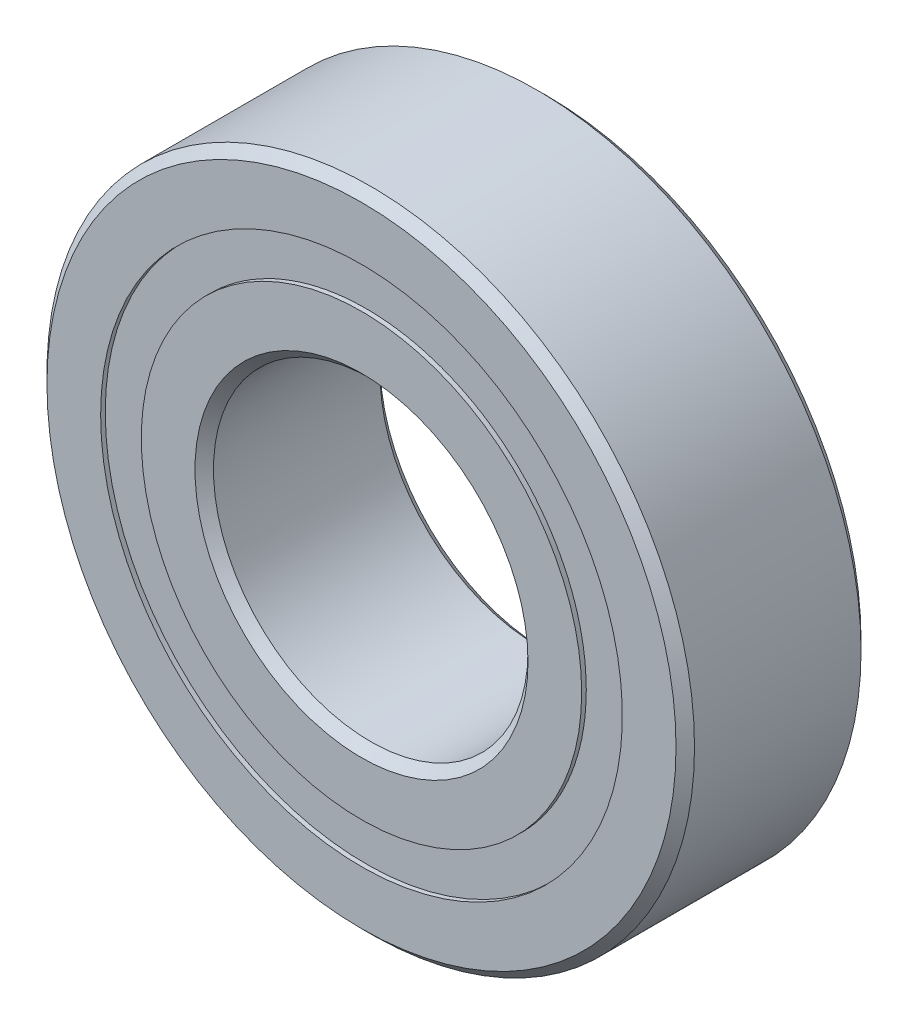
ISO-10303-21;
HEADER;
FILE_DESCRIPTION(('STEP AP214'),'2;1');
FILE_NAME('part.step','',(''),(''),'','','');
FILE_SCHEMA(('AUTOMOTIVE_DESIGN { 1 0 10303 214 1 1 1 1 }'));
ENDSEC;
DATA;
#1=APPLICATION_CONTEXT('core data for automotive mechanical design processes');
#2=APPLICATION_PROTOCOL_DEFINITION('international standard','automotive_design',2000,#1);
#3=PRODUCT_CONTEXT('',#1,'mechanical');
#4=PRODUCT('Part','Part','',(#3));
#5=PRODUCT_RELATED_PRODUCT_CATEGORY('part','',(#4));
#6=PRODUCT_DEFINITION_FORMATION('','',#4);
#7=PRODUCT_DEFINITION_CONTEXT('part definition',#1,'design');
#8=PRODUCT_DEFINITION('design','',#6,#7);
#9=PRODUCT_DEFINITION_SHAPE('','',#8);
#10=(LENGTH_UNIT() NAMED_UNIT(*) SI_UNIT(.MILLI.,.METRE.));
#11=(NAMED_UNIT(*) PLANE_ANGLE_UNIT() SI_UNIT($,.RADIAN.));
#12=(NAMED_UNIT(*) SI_UNIT($,.STERADIAN.) SOLID_ANGLE_UNIT());
#13=UNCERTAINTY_MEASURE_WITH_UNIT(LENGTH_MEASURE(1.E-05),#10,'distance_accuracy_value','');
#14=(GEOMETRIC_REPRESENTATION_CONTEXT(3) GLOBAL_UNCERTAINTY_ASSIGNED_CONTEXT((#13)) GLOBAL_UNIT_ASSIGNED_CONTEXT((#10,
#11,#12)) REPRESENTATION_CONTEXT('',''));
#15=CARTESIAN_POINT('',(0.,0.,0.));
#16=DIRECTION('',(0.,0.,1.));
#17=DIRECTION('',(1.,0.,0.));
#18=AXIS2_PLACEMENT_3D('',#15,#16,#17);
#19=CARTESIAN_POINT('',(0.,0.,5.));
#20=DIRECTION('',(0.,0.,1.));
#21=DIRECTION('',(-1.,0.,0.));
#22=AXIS2_PLACEMENT_3D('',#19,#20,#21);
#23=CYLINDRICAL_SURFACE('',#22,14.0989010989011);
#24=CARTESIAN_POINT('',(0.,0.,-4.75));
#25=DIRECTION('',(0.,0.,-1.));
#26=DIRECTION('',(-1.,0.,0.));
#27=AXIS2_PLACEMENT_3D('',#24,#25,#26);
#28=CIRCLE('',#27,14.0989010989011);
#29=CARTESIAN_POINT('',(-14.0989010989011,0.,-4.75));
#30=VERTEX_POINT('',#29);
#31=EDGE_CURVE('E11',#30,#30,#28,.T.);
#32=ORIENTED_EDGE('',*,*,#31,.F.);
#33=EDGE_LOOP('',(#32));
#34=FACE_BOUND('',#33,.T.);
#35=CARTESIAN_POINT('',(0.,0.,-5.));
#36=DIRECTION('',(0.,0.,-1.));
#37=DIRECTION('',(-1.,0.,0.));
#38=AXIS2_PLACEMENT_3D('',#35,#36,#37);
#39=CIRCLE('',#38,14.0989010989011);
#40=CARTESIAN_POINT('',(-14.0989010989011,0.,-5.));
#41=VERTEX_POINT('',#40);
#42=EDGE_CURVE('E103',#41,#41,#39,.T.);
#43=ORIENTED_EDGE('',*,*,#42,.T.);
#44=EDGE_LOOP('',(#43));
#45=FACE_BOUND('',#44,.T.);
#46=ADVANCED_FACE('F52',(#34,#45),#23,.F.);
#47=CARTESIAN_POINT('',(0.,14.0989010989011,-4.75));
#48=DIRECTION('',(0.,0.,-1.));
#49=DIRECTION('',(1.,0.,0.));
#50=AXIS2_PLACEMENT_3D('',#47,#48,#49);
#51=PLANE('',#50);
#52=CARTESIAN_POINT('',(0.,0.,-4.75));
#53=DIRECTION('',(0.,0.,-1.));
#54=DIRECTION('',(-1.,0.,0.));
#55=AXIS2_PLACEMENT_3D('',#52,#53,#54);
#56=CIRCLE('',#55,11.9010989010989);
#57=CARTESIAN_POINT('',(-11.9010989010989,0.,-4.75));
#58=VERTEX_POINT('',#57);
#59=EDGE_CURVE('E59',#58,#58,#56,.T.);
#60=ORIENTED_EDGE('',*,*,#59,.F.);
#61=EDGE_LOOP('',(#60));
#62=FACE_BOUND('',#61,.T.);
#63=ORIENTED_EDGE('',*,*,#31,.T.);
#64=EDGE_LOOP('',(#63));
#65=FACE_BOUND('',#64,.T.);
#66=ADVANCED_FACE('F165',(#62,#65),#51,.T.);
#67=CARTESIAN_POINT('',(0.,0.,5.));
#68=DIRECTION('',(0.,0.,1.));
#69=DIRECTION('',(-1.,0.,0.));
#70=AXIS2_PLACEMENT_3D('',#67,#68,#69);
#71=CYLINDRICAL_SURFACE('',#70,11.9010989010989);
#72=CARTESIAN_POINT('',(0.,0.,-2.47908354641475));
#73=DIRECTION('',(0.,0.,-1.));
#74=DIRECTION('',(-1.,0.,0.));
#75=AXIS2_PLACEMENT_3D('',#72,#73,#74);
#76=CIRCLE('',#75,11.9010989010989);
#77=CARTESIAN_POINT('',(-11.9010989010989,0.,-2.47908354641475));
#78=VERTEX_POINT('',#77);
#79=EDGE_CURVE('E64',#78,#78,#76,.T.);
#80=ORIENTED_EDGE('',*,*,#79,.F.);
#81=EDGE_LOOP('',(#80));
#82=FACE_BOUND('',#81,.T.);
#83=ORIENTED_EDGE('',*,*,#59,.T.);
#84=EDGE_LOOP('',(#83));
#85=FACE_BOUND('',#84,.T.);
#86=ADVANCED_FACE('F160',(#82,#85),#71,.F.);
#87=CARTESIAN_POINT('',(0.,13.0637193818456,-2.47908354641475));
#88=DIRECTION('',(0.,0.,1.));
#89=DIRECTION('',(-1.,0.,0.));
#90=AXIS2_PLACEMENT_3D('',#87,#88,#89);
#91=PLANE('',#90);
#92=CARTESIAN_POINT('',(0.,0.,-2.47908354641475));
#93=DIRECTION('',(0.,0.,-1.));
#94=DIRECTION('',(-1.,0.,0.));
#95=AXIS2_PLACEMENT_3D('',#92,#93,#94);
#96=CIRCLE('',#95,13.0637193818456);
#97=CARTESIAN_POINT('',(-13.0637193818456,0.,-2.47908354641475));
#98=VERTEX_POINT('',#97);
#99=EDGE_CURVE('E69',#98,#98,#96,.T.);
#100=ORIENTED_EDGE('',*,*,#99,.F.);
#101=EDGE_LOOP('',(#100));
#102=FACE_BOUND('',#101,.T.);
#103=ORIENTED_EDGE('',*,*,#79,.T.);
#104=EDGE_LOOP('',(#103));
#105=FACE_BOUND('',#104,.T.);
#106=ADVANCED_FACE('F154',(#102,#105),#91,.T.);
#107=CARTESIAN_POINT('',(0.,0.,0.));
#108=DIRECTION('',(0.,0.,1.));
#109=DIRECTION('',(-1.,0.,0.));
#110=AXIS2_PLACEMENT_3D('',#107,#108,#109);
#111=TOROIDAL_SURFACE('',#110,12.9963044732891,2.48);
#112=CARTESIAN_POINT('',(0.,0.,2.47908354641475));
#113=DIRECTION('',(0.,0.,-1.));
#114=DIRECTION('',(-1.,0.,0.));
#115=AXIS2_PLACEMENT_3D('',#112,#113,#114);
#116=CIRCLE('',#115,13.0637193818456);
#117=CARTESIAN_POINT('',(-13.0637193818456,0.,2.47908354641475));
#118=VERTEX_POINT('',#117);
#119=EDGE_CURVE('E75',#118,#118,#116,.T.);
#120=ORIENTED_EDGE('',*,*,#119,.F.);
#121=EDGE_LOOP('',(#120));
#122=FACE_BOUND('',#121,.T.);
#123=ORIENTED_EDGE('',*,*,#99,.T.);
#124=EDGE_LOOP('',(#123));
#125=FACE_BOUND('',#124,.T.);
#126=ADVANCED_FACE('F148',(#122,#125),#111,.F.);
#127=CARTESIAN_POINT('',(0.,13.0637193818456,2.47908354641475));
#128=DIRECTION('',(0.,0.,-1.));
#129=DIRECTION('',(1.,0.,0.));
#130=AXIS2_PLACEMENT_3D('',#127,#128,#129);
#131=PLANE('',#130);
#132=CARTESIAN_POINT('',(0.,0.,2.47908354641475));
#133=DIRECTION('',(0.,0.,-1.));
#134=DIRECTION('',(-1.,0.,0.));
#135=AXIS2_PLACEMENT_3D('',#132,#133,#134);
#136=CIRCLE('',#135,11.9010989010989);
#137=CARTESIAN_POINT('',(-11.9010989010989,0.,2.47908354641475));
#138=VERTEX_POINT('',#137);
#139=EDGE_CURVE('E79',#138,#138,#136,.T.);
#140=ORIENTED_EDGE('',*,*,#139,.F.);
#141=EDGE_LOOP('',(#140));
#142=FACE_BOUND('',#141,.T.);
#143=ORIENTED_EDGE('',*,*,#119,.T.);
#144=EDGE_LOOP('',(#143));
#145=FACE_BOUND('',#144,.T.);
#146=ADVANCED_FACE('F142',(#142,#145),#131,.T.);
#147=CARTESIAN_POINT('',(0.,0.,5.));
#148=DIRECTION('',(0.,0.,1.));
#149=DIRECTION('',(-1.,0.,0.));
#150=AXIS2_PLACEMENT_3D('',#147,#148,#149);
#151=CYLINDRICAL_SURFACE('',#150,11.9010989010989);
#152=CARTESIAN_POINT('',(0.,0.,4.75));
#153=DIRECTION('',(0.,0.,-1.));
#154=DIRECTION('',(-1.,0.,0.));
#155=AXIS2_PLACEMENT_3D('',#152,#153,#154);
#156=CIRCLE('',#155,11.9010989010989);
#157=CARTESIAN_POINT('',(-11.9010989010989,0.,4.75));
#158=VERTEX_POINT('',#157);
#159=EDGE_CURVE('E83',#158,#158,#156,.T.);
#160=ORIENTED_EDGE('',*,*,#159,.F.);
#161=EDGE_LOOP('',(#160));
#162=FACE_BOUND('',#161,.T.);
#163=ORIENTED_EDGE('',*,*,#139,.T.);
#164=EDGE_LOOP('',(#163));
#165=FACE_BOUND('',#164,.T.);
#166=ADVANCED_FACE('F136',(#162,#165),#151,.F.);
#167=CARTESIAN_POINT('',(0.,14.0989010989011,4.75));
#168=DIRECTION('',(0.,0.,1.));
#169=DIRECTION('',(-1.,0.,0.));
#170=AXIS2_PLACEMENT_3D('',#167,#168,#169);
#171=PLANE('',#170);
#172=CARTESIAN_POINT('',(0.,0.,4.75));
#173=DIRECTION('',(0.,0.,-1.));
#174=DIRECTION('',(-1.,0.,0.));
#175=AXIS2_PLACEMENT_3D('',#172,#173,#174);
#176=CIRCLE('',#175,14.0989010989011);
#177=CARTESIAN_POINT('',(-14.0989010989011,0.,4.75));
#178=VERTEX_POINT('',#177);
#179=EDGE_CURVE('E87',#178,#178,#176,.T.);
#180=ORIENTED_EDGE('',*,*,#179,.F.);
#181=EDGE_LOOP('',(#180));
#182=FACE_BOUND('',#181,.T.);
#183=ORIENTED_EDGE('',*,*,#159,.T.);
#184=EDGE_LOOP('',(#183));
#185=FACE_BOUND('',#184,.T.);
#186=ADVANCED_FACE('F130',(#182,#185),#171,.T.);
#187=CARTESIAN_POINT('',(0.,0.,5.));
#188=DIRECTION('',(0.,0.,1.));
#189=DIRECTION('',(-1.,0.,0.));
#190=AXIS2_PLACEMENT_3D('',#187,#188,#189);
#191=CYLINDRICAL_SURFACE('',#190,14.0989010989011);
#192=CARTESIAN_POINT('',(0.,0.,5.));
#193=DIRECTION('',(0.,0.,-1.));
#194=DIRECTION('',(-1.,0.,0.));
#195=AXIS2_PLACEMENT_3D('',#192,#193,#194);
#196=CIRCLE('',#195,14.0989010989011);
#197=CARTESIAN_POINT('',(-14.0989010989011,0.,5.));
#198=VERTEX_POINT('',#197);
#199=EDGE_CURVE('E91',#198,#198,#196,.T.);
#200=ORIENTED_EDGE('',*,*,#199,.F.);
#201=EDGE_LOOP('',(#200));
#202=FACE_BOUND('',#201,.T.);
#203=ORIENTED_EDGE('',*,*,#179,.T.);
#204=EDGE_LOOP('',(#203));
#205=FACE_BOUND('',#204,.T.);
#206=ADVANCED_FACE('F124',(#202,#205),#191,.F.);
#207=CARTESIAN_POINT('',(0.,17.,5.));
#208=DIRECTION('',(0.,0.,1.));
#209=DIRECTION('',(-1.,0.,0.));
#210=AXIS2_PLACEMENT_3D('',#207,#208,#209);
#211=PLANE('',#210);
#212=CARTESIAN_POINT('',(0.,0.,5.));
#213=DIRECTION('',(0.,0.,-1.));
#214=DIRECTION('',(-1.,0.,0.));
#215=AXIS2_PLACEMENT_3D('',#212,#213,#214);
#216=CIRCLE('',#215,17.);
#217=CARTESIAN_POINT('',(-17.,0.,5.));
#218=VERTEX_POINT('',#217);
#219=EDGE_CURVE('E95',#218,#218,#216,.T.);
#220=ORIENTED_EDGE('',*,*,#219,.F.);
#221=EDGE_LOOP('',(#220));
#222=FACE_BOUND('',#221,.T.);
#223=ORIENTED_EDGE('',*,*,#199,.T.);
#224=EDGE_LOOP('',(#223));
#225=FACE_BOUND('',#224,.T.);
#226=ADVANCED_FACE('F118',(#222,#225),#211,.T.);
#227=CARTESIAN_POINT('',(0.,0.,5.));
#228=DIRECTION('',(0.,0.,1.));
#229=DIRECTION('',(-1.,0.,0.));
#230=AXIS2_PLACEMENT_3D('',#227,#228,#229);
#231=CYLINDRICAL_SURFACE('',#230,17.);
#232=CARTESIAN_POINT('',(0.,0.,-5.));
#233=DIRECTION('',(0.,0.,-1.));
#234=DIRECTION('',(-1.,0.,0.));
#235=AXIS2_PLACEMENT_3D('',#232,#233,#234);
#236=CIRCLE('',#235,17.);
#237=CARTESIAN_POINT('',(-17.,0.,-5.));
#238=VERTEX_POINT('',#237);
#239=EDGE_CURVE('E99',#238,#238,#236,.T.);
#240=ORIENTED_EDGE('',*,*,#239,.F.);
#241=EDGE_LOOP('',(#240));
#242=FACE_BOUND('',#241,.T.);
#243=ORIENTED_EDGE('',*,*,#219,.T.);
#244=EDGE_LOOP('',(#243));
#245=FACE_BOUND('',#244,.T.);
#246=ADVANCED_FACE('F112',(#242,#245),#231,.T.);
#247=CARTESIAN_POINT('',(0.,17.,-5.));
#248=DIRECTION('',(0.,0.,-1.));
#249=DIRECTION('',(1.,0.,0.));
#250=AXIS2_PLACEMENT_3D('',#247,#248,#249);
#251=PLANE('',#250);
#252=ORIENTED_EDGE('',*,*,#42,.F.);
#253=EDGE_LOOP('',(#252));
#254=FACE_BOUND('',#253,.T.);
#255=ORIENTED_EDGE('',*,*,#239,.T.);
#256=EDGE_LOOP('',(#255));
#257=FACE_BOUND('',#256,.T.);
#258=ADVANCED_FACE('F109',(#254,#257),#251,.T.);
#259=CLOSED_SHELL('',(#46,#66,#86,#106,#126,#146,#166,#186,#206,#226,#246,#258));
#260=MANIFOLD_SOLID_BREP('B2',#259);
#261=CARTESIAN_POINT('',(0.,9.,-5.));
#262=DIRECTION('',(0.,0.,1.));
#263=DIRECTION('',(-1.,0.,0.));
#264=AXIS2_PLACEMENT_3D('',#261,#262,#263);
#265=PLANE('',#264);
#266=CARTESIAN_POINT('',(0.,0.,-5.));
#267=DIRECTION('',(0.,0.,1.));
#268=DIRECTION('',(1.,0.,0.));
#269=AXIS2_PLACEMENT_3D('',#266,#267,#268);
#270=CIRCLE('',#269,9.);
#271=CARTESIAN_POINT('',(9.,0.,-5.));
#272=VERTEX_POINT('',#271);
#273=EDGE_CURVE('E51',#272,#272,#270,.T.);
#274=ORIENTED_EDGE('',*,*,#273,.T.);
#275=EDGE_LOOP('',(#274));
#276=FACE_BOUND('',#275,.T.);
#277=CARTESIAN_POINT('',(0.,0.,-5.));
#278=DIRECTION('',(0.,0.,1.));
#279=DIRECTION('',(1.,0.,0.));
#280=AXIS2_PLACEMENT_3D('',#277,#278,#279);
#281=CIRCLE('',#280,11.9010989010989);
#282=CARTESIAN_POINT('',(11.9010989010989,0.,-5.));
#283=VERTEX_POINT('',#282);
#284=EDGE_CURVE('E256',#283,#283,#281,.T.);
#285=ORIENTED_EDGE('',*,*,#284,.F.);
#286=EDGE_LOOP('',(#285));
#287=FACE_BOUND('',#286,.T.);
#288=ADVANCED_FACE('F228',(#276,#287),#265,.F.);
#289=CARTESIAN_POINT('',(0.,0.,-5.));
#290=DIRECTION('',(0.,0.,-1.));
#291=DIRECTION('',(1.,0.,0.));
#292=AXIS2_PLACEMENT_3D('',#289,#290,#291);
#293=CONICAL_SURFACE('',#292,9.,0.785398163397452);
#294=CARTESIAN_POINT('',(0.,0.,-4.5));
#295=DIRECTION('',(0.,0.,1.));
#296=DIRECTION('',(1.,0.,0.));
#297=AXIS2_PLACEMENT_3D('',#294,#295,#296);
#298=CIRCLE('',#297,8.5);
#299=CARTESIAN_POINT('',(8.5,0.,-4.5));
#300=VERTEX_POINT('',#299);
#301=EDGE_CURVE('E234',#300,#300,#298,.T.);
#302=ORIENTED_EDGE('',*,*,#301,.T.);
#303=EDGE_LOOP('',(#302));
#304=FACE_BOUND('',#303,.T.);
#305=ORIENTED_EDGE('',*,*,#273,.F.);
#306=EDGE_LOOP('',(#305));
#307=FACE_BOUND('',#306,.T.);
#308=ADVANCED_FACE('F264',(#304,#307),#293,.F.);
#309=CARTESIAN_POINT('',(0.,0.,-5.));
#310=DIRECTION('',(0.,0.,-1.));
#311=DIRECTION('',(1.,0.,0.));
#312=AXIS2_PLACEMENT_3D('',#309,#310,#311);
#313=CYLINDRICAL_SURFACE('',#312,8.5);
#314=CARTESIAN_POINT('',(0.,0.,4.5));
#315=DIRECTION('',(0.,0.,1.));
#316=DIRECTION('',(1.,0.,0.));
#317=AXIS2_PLACEMENT_3D('',#314,#315,#316);
#318=CIRCLE('',#317,8.5);
#319=CARTESIAN_POINT('',(8.5,0.,4.5));
#320=VERTEX_POINT('',#319);
#321=EDGE_CURVE('E238',#320,#320,#318,.T.);
#322=ORIENTED_EDGE('',*,*,#321,.T.);
#323=EDGE_LOOP('',(#322));
#324=FACE_BOUND('',#323,.T.);
#325=ORIENTED_EDGE('',*,*,#301,.F.);
#326=EDGE_LOOP('',(#325));
#327=FACE_BOUND('',#326,.T.);
#328=ADVANCED_FACE('F268',(#324,#327),#313,.F.);
#329=CARTESIAN_POINT('',(0.,0.,4.5));
#330=DIRECTION('',(0.,0.,1.));
#331=DIRECTION('',(-1.,0.,0.));
#332=AXIS2_PLACEMENT_3D('',#329,#330,#331);
#333=CONICAL_SURFACE('',#332,8.5,0.785398163397442);
#334=CARTESIAN_POINT('',(0.,0.,5.));
#335=DIRECTION('',(0.,0.,1.));
#336=DIRECTION('',(1.,0.,0.));
#337=AXIS2_PLACEMENT_3D('',#334,#335,#336);
#338=CIRCLE('',#337,9.);
#339=CARTESIAN_POINT('',(9.,0.,5.));
#340=VERTEX_POINT('',#339);
#341=EDGE_CURVE('E242',#340,#340,#338,.T.);
#342=ORIENTED_EDGE('',*,*,#341,.T.);
#343=EDGE_LOOP('',(#342));
#344=FACE_BOUND('',#343,.T.);
#345=ORIENTED_EDGE('',*,*,#321,.F.);
#346=EDGE_LOOP('',(#345));
#347=FACE_BOUND('',#346,.T.);
#348=ADVANCED_FACE('F272',(#344,#347),#333,.F.);
#349=CARTESIAN_POINT('',(0.,9.,5.));
#350=DIRECTION('',(0.,0.,-1.));
#351=DIRECTION('',(1.,0.,0.));
#352=AXIS2_PLACEMENT_3D('',#349,#350,#351);
#353=PLANE('',#352);
#354=CARTESIAN_POINT('',(0.,0.,5.));
#355=DIRECTION('',(0.,0.,1.));
#356=DIRECTION('',(1.,0.,0.));
#357=AXIS2_PLACEMENT_3D('',#354,#355,#356);
#358=CIRCLE('',#357,11.9010989010989);
#359=CARTESIAN_POINT('',(11.9010989010989,0.,5.));
#360=VERTEX_POINT('',#359);
#361=EDGE_CURVE('E247',#360,#360,#358,.T.);
#362=ORIENTED_EDGE('',*,*,#361,.T.);
#363=EDGE_LOOP('',(#362));
#364=FACE_BOUND('',#363,.T.);
#365=ORIENTED_EDGE('',*,*,#341,.F.);
#366=EDGE_LOOP('',(#365));
#367=FACE_BOUND('',#366,.T.);
#368=ADVANCED_FACE('F279',(#364,#367),#353,.F.);
#369=CARTESIAN_POINT('',(0.,0.,-5.));
#370=DIRECTION('',(0.,0.,-1.));
#371=DIRECTION('',(1.,0.,0.));
#372=AXIS2_PLACEMENT_3D('',#369,#370,#371);
#373=CYLINDRICAL_SURFACE('',#372,11.9010989010989);
#374=CARTESIAN_POINT('',(0.,0.,2.22222222222222));
#375=DIRECTION('',(0.,0.,1.));
#376=DIRECTION('',(1.,0.,0.));
#377=AXIS2_PLACEMENT_3D('',#374,#375,#376);
#378=CIRCLE('',#377,11.9010989010989);
#379=CARTESIAN_POINT('',(11.9010989010989,0.,2.22222222222222));
#380=VERTEX_POINT('',#379);
#381=EDGE_CURVE('E250',#380,#380,#378,.T.);
#382=ORIENTED_EDGE('',*,*,#381,.T.);
#383=EDGE_LOOP('',(#382));
#384=FACE_BOUND('',#383,.T.);
#385=ORIENTED_EDGE('',*,*,#361,.F.);
#386=EDGE_LOOP('',(#385));
#387=FACE_BOUND('',#386,.T.);
#388=ADVANCED_FACE('F283',(#384,#387),#373,.T.);
#389=CARTESIAN_POINT('',(0.,0.,0.));
#390=DIRECTION('',(0.,0.,-1.));
#391=DIRECTION('',(1.,0.,0.));
#392=AXIS2_PLACEMENT_3D('',#389,#390,#391);
#393=TOROIDAL_SURFACE('',#392,13.,2.47908354641474);
#394=CARTESIAN_POINT('',(0.,0.,-2.22222222222222));
#395=DIRECTION('',(0.,0.,1.));
#396=DIRECTION('',(1.,0.,0.));
#397=AXIS2_PLACEMENT_3D('',#394,#395,#396);
#398=CIRCLE('',#397,11.9010989010989);
#399=CARTESIAN_POINT('',(11.9010989010989,0.,-2.22222222222222));
#400=VERTEX_POINT('',#399);
#401=EDGE_CURVE('E253',#400,#400,#398,.T.);
#402=ORIENTED_EDGE('',*,*,#401,.T.);
#403=EDGE_LOOP('',(#402));
#404=FACE_BOUND('',#403,.T.);
#405=ORIENTED_EDGE('',*,*,#381,.F.);
#406=EDGE_LOOP('',(#405));
#407=FACE_BOUND('',#406,.T.);
#408=ADVANCED_FACE('F287',(#404,#407),#393,.F.);
#409=CARTESIAN_POINT('',(0.,0.,-5.));
#410=DIRECTION('',(0.,0.,-1.));
#411=DIRECTION('',(1.,0.,0.));
#412=AXIS2_PLACEMENT_3D('',#409,#410,#411);
#413=CYLINDRICAL_SURFACE('',#412,11.9010989010989);
#414=ORIENTED_EDGE('',*,*,#284,.T.);
#415=EDGE_LOOP('',(#414));
#416=FACE_BOUND('',#415,.T.);
#417=ORIENTED_EDGE('',*,*,#401,.F.);
#418=EDGE_LOOP('',(#417));
#419=FACE_BOUND('',#418,.T.);
#420=ADVANCED_FACE('F260',(#416,#419),#413,.T.);
#421=CLOSED_SHELL('',(#288,#308,#328,#348,#368,#388,#408,#420));
#422=MANIFOLD_SOLID_BREP('B6',#421);
#423=CARTESIAN_POINT('',(-7.64120827980202,10.5172209268744,0.));
#424=DIRECTION('',(0.,0.,-1.));
#425=DIRECTION('',(-0.587785252292463,0.809016994374955,0.));
#426=AXIS2_PLACEMENT_3D('',#423,#424,#425);
#427=SPHERICAL_SURFACE('',#426,2.47908354641475);
#428=CARTESIAN_POINT('',(-7.64120827980202,10.5172209268744,-2.47908354641474));
#429=VERTEX_POINT('',#428);
#430=VERTEX_LOOP('',#429);
#431=FACE_BOUND('',#430,.T.);
#432=ADVANCED_FACE('F340',(#431),#427,.T.);
#433=CLOSED_SHELL('',(#432));
#434=MANIFOLD_SOLID_BREP('B46',#433);
#435=CARTESIAN_POINT('',(-12.363734711837,4.01722092687446,0.));
#436=DIRECTION('',(0.,0.,-1.));
#437=DIRECTION('',(-0.95105651629515,0.309016994374958,0.));
#438=AXIS2_PLACEMENT_3D('',#435,#436,#437);
#439=SPHERICAL_SURFACE('',#438,2.47908354641475);
#440=CARTESIAN_POINT('',(-12.363734711837,4.01722092687446,-2.47908354641474));
#441=VERTEX_POINT('',#440);
#442=VERTEX_LOOP('',#441);
#443=FACE_BOUND('',#442,.T.);
#444=ADVANCED_FACE('F357',(#443),#439,.T.);
#445=CLOSED_SHELL('',(#444));
#446=MANIFOLD_SOLID_BREP('B224',#445);
#447=CARTESIAN_POINT('',(-12.363734711837,-4.0172209268742,0.));
#448=DIRECTION('',(0.,0.,-1.));
#449=DIRECTION('',(-0.951056516295157,-0.309016994374939,0.));
#450=AXIS2_PLACEMENT_3D('',#447,#448,#449);
#451=SPHERICAL_SURFACE('',#450,2.47908354641475);
#452=CARTESIAN_POINT('',(-12.363734711837,-4.0172209268742,-2.47908354641475));
#453=VERTEX_POINT('',#452);
#454=VERTEX_LOOP('',#453);
#455=FACE_BOUND('',#454,.T.);
#456=ADVANCED_FACE('F374',(#455),#451,.T.);
#457=CLOSED_SHELL('',(#456));
#458=MANIFOLD_SOLID_BREP('B336',#457);
#459=CARTESIAN_POINT('',(-7.64120827980225,-10.5172209268742,0.));
#460=DIRECTION('',(0.,0.,-1.));
#461=DIRECTION('',(-0.58778525229248,-0.809016994374943,0.));
#462=AXIS2_PLACEMENT_3D('',#459,#460,#461);
#463=SPHERICAL_SURFACE('',#462,2.47908354641475);
#464=CARTESIAN_POINT('',(-7.64120827980225,-10.5172209268742,-2.47908354641475));
#465=VERTEX_POINT('',#464);
#466=VERTEX_LOOP('',#465);
#467=FACE_BOUND('',#466,.T.);
#468=ADVANCED_FACE('F391',(#467),#463,.T.);
#469=CLOSED_SHELL('',(#468));
#470=MANIFOLD_SOLID_BREP('B353',#469);
#471=CARTESIAN_POINT('',(0.,-13.,0.));
#472=DIRECTION('',(0.,0.,-1.));
#473=DIRECTION('',(0.,-1.,0.));
#474=AXIS2_PLACEMENT_3D('',#471,#472,#473);
#475=SPHERICAL_SURFACE('',#474,2.47908354641475);
#476=CARTESIAN_POINT('',(0.,-13.,-2.47908354641474));
#477=VERTEX_POINT('',#476);
#478=VERTEX_LOOP('',#477);
#479=FACE_BOUND('',#478,.T.);
#480=ADVANCED_FACE('F408',(#479),#475,.T.);
#481=CLOSED_SHELL('',(#480));
#482=MANIFOLD_SOLID_BREP('B370',#481);
#483=CARTESIAN_POINT('',(7.6412082798021,-10.5172209268744,0.));
#484=DIRECTION('',(0.,0.,-1.));
#485=DIRECTION('',(0.587785252292469,-0.809016994374951,0.));
#486=AXIS2_PLACEMENT_3D('',#483,#484,#485);
#487=SPHERICAL_SURFACE('',#486,2.47908354641475);
#488=CARTESIAN_POINT('',(7.6412082798021,-10.5172209268744,-2.47908354641474));
#489=VERTEX_POINT('',#488);
#490=VERTEX_LOOP('',#489);
#491=FACE_BOUND('',#490,.T.);
#492=ADVANCED_FACE('F425',(#491),#487,.T.);
#493=CLOSED_SHELL('',(#492));
#494=MANIFOLD_SOLID_BREP('B387',#493);
#495=CARTESIAN_POINT('',(12.363734711837,-4.01722092687438,0.));
#496=DIRECTION('',(0.,0.,-1.));
#497=DIRECTION('',(0.951056516295153,-0.309016994374952,0.));
#498=AXIS2_PLACEMENT_3D('',#495,#496,#497);
#499=SPHERICAL_SURFACE('',#498,2.47908354641475);
#500=CARTESIAN_POINT('',(12.363734711837,-4.01722092687438,-2.47908354641475));
#501=VERTEX_POINT('',#500);
#502=VERTEX_LOOP('',#501);
#503=FACE_BOUND('',#502,.T.);
#504=ADVANCED_FACE('F442',(#503),#499,.T.);
#505=CLOSED_SHELL('',(#504));
#506=MANIFOLD_SOLID_BREP('B404',#505);
#507=CARTESIAN_POINT('',(12.363734711837,4.01722092687428,0.));
#508=DIRECTION('',(0.,0.,-1.));
#509=DIRECTION('',(0.951056516295155,0.309016994374945,0.));
#510=AXIS2_PLACEMENT_3D('',#507,#508,#509);
#511=SPHERICAL_SURFACE('',#510,2.47908354641475);
#512=CARTESIAN_POINT('',(12.363734711837,4.01722092687428,-2.47908354641474));
#513=VERTEX_POINT('',#512);
#514=VERTEX_LOOP('',#513);
#515=FACE_BOUND('',#514,.T.);
#516=ADVANCED_FACE('F459',(#515),#511,.T.);
#517=CLOSED_SHELL('',(#516));
#518=MANIFOLD_SOLID_BREP('B421',#517);
#519=CARTESIAN_POINT('',(7.64120827980217,10.5172209268743,0.));
#520=DIRECTION('',(0.,0.,-1.));
#521=DIRECTION('',(0.587785252292475,0.809016994374947,0.));
#522=AXIS2_PLACEMENT_3D('',#519,#520,#521);
#523=SPHERICAL_SURFACE('',#522,2.47908354641475);
#524=CARTESIAN_POINT('',(7.64120827980217,10.5172209268743,-2.47908354641474));
#525=VERTEX_POINT('',#524);
#526=VERTEX_LOOP('',#525);
#527=FACE_BOUND('',#526,.T.);
#528=ADVANCED_FACE('F476',(#527),#523,.T.);
#529=CLOSED_SHELL('',(#528));
#530=MANIFOLD_SOLID_BREP('B438',#529);
#531=CARTESIAN_POINT('',(0.,13.,0.));
#532=DIRECTION('',(0.,0.,-1.));
#533=DIRECTION('',(0.,1.,0.));
#534=AXIS2_PLACEMENT_3D('',#531,#532,#533);
#535=SPHERICAL_SURFACE('',#534,2.47908354641475);
#536=CARTESIAN_POINT('',(0.,13.,-2.47908354641475));
#537=VERTEX_POINT('',#536);
#538=VERTEX_LOOP('',#537);
#539=FACE_BOUND('',#538,.T.);
#540=ADVANCED_FACE('F494',(#539),#535,.T.);
#541=CLOSED_SHELL('',(#540));
#542=MANIFOLD_SOLID_BREP('B455',#541);
#543=CARTESIAN_POINT('',(0.,0.,-4.5));
#544=DIRECTION('',(0.,0.,1.));
#545=DIRECTION('',(-1.,0.,0.));
#546=AXIS2_PLACEMENT_3D('',#543,#544,#545);
#547=CONICAL_SURFACE('',#546,17.5,0.785398163397446);
#548=CARTESIAN_POINT('',(0.,0.,-5.));
#549=DIRECTION('',(0.,0.,1.));
#550=DIRECTION('',(1.,0.,0.));
#551=AXIS2_PLACEMENT_3D('',#548,#549,#550);
#552=CIRCLE('',#551,17.);
#553=CARTESIAN_POINT('',(17.,0.,-5.));
#554=VERTEX_POINT('',#553);
#555=EDGE_CURVE('E493',#554,#554,#552,.T.);
#556=ORIENTED_EDGE('',*,*,#555,.T.);
#557=EDGE_LOOP('',(#556));
#558=FACE_BOUND('',#557,.T.);
#559=CARTESIAN_POINT('',(0.,0.,-4.5));
#560=DIRECTION('',(0.,0.,1.));
#561=DIRECTION('',(1.,0.,0.));
#562=AXIS2_PLACEMENT_3D('',#559,#560,#561);
#563=CIRCLE('',#562,17.5);
#564=CARTESIAN_POINT('',(17.5,0.,-4.5));
#565=VERTEX_POINT('',#564);
#566=EDGE_CURVE('E519',#565,#565,#563,.T.);
#567=ORIENTED_EDGE('',*,*,#566,.F.);
#568=EDGE_LOOP('',(#567));
#569=FACE_BOUND('',#568,.T.);
#570=ADVANCED_FACE('F505',(#558,#569),#547,.T.);
#571=CARTESIAN_POINT('',(0.,0.,-5.));
#572=DIRECTION('',(0.,0.,-1.));
#573=DIRECTION('',(1.,0.,0.));
#574=AXIS2_PLACEMENT_3D('',#571,#572,#573);
#575=CYLINDRICAL_SURFACE('',#574,17.);
#576=CARTESIAN_POINT('',(0.,0.,5.));
#577=DIRECTION('',(0.,0.,1.));
#578=DIRECTION('',(1.,0.,0.));
#579=AXIS2_PLACEMENT_3D('',#576,#577,#578);
#580=CIRCLE('',#579,17.);
#581=CARTESIAN_POINT('',(17.,0.,5.));
#582=VERTEX_POINT('',#581);
#583=EDGE_CURVE('E511',#582,#582,#580,.T.);
#584=ORIENTED_EDGE('',*,*,#583,.T.);
#585=EDGE_LOOP('',(#584));
#586=FACE_BOUND('',#585,.T.);
#587=ORIENTED_EDGE('',*,*,#555,.F.);
#588=EDGE_LOOP('',(#587));
#589=FACE_BOUND('',#588,.T.);
#590=ADVANCED_FACE('F529',(#586,#589),#575,.F.);
#591=CARTESIAN_POINT('',(0.,0.,5.));
#592=DIRECTION('',(0.,0.,-1.));
#593=DIRECTION('',(1.,0.,0.));
#594=AXIS2_PLACEMENT_3D('',#591,#592,#593);
#595=CONICAL_SURFACE('',#594,17.,0.785398163397445);
#596=CARTESIAN_POINT('',(0.,0.,4.5));
#597=DIRECTION('',(0.,0.,1.));
#598=DIRECTION('',(1.,0.,0.));
#599=AXIS2_PLACEMENT_3D('',#596,#597,#598);
#600=CIRCLE('',#599,17.5);
#601=CARTESIAN_POINT('',(17.5,0.,4.5));
#602=VERTEX_POINT('',#601);
#603=EDGE_CURVE('E515',#602,#602,#600,.T.);
#604=ORIENTED_EDGE('',*,*,#603,.T.);
#605=EDGE_LOOP('',(#604));
#606=FACE_BOUND('',#605,.T.);
#607=ORIENTED_EDGE('',*,*,#583,.F.);
#608=EDGE_LOOP('',(#607));
#609=FACE_BOUND('',#608,.T.);
#610=ADVANCED_FACE('F533',(#606,#609),#595,.T.);
#611=CARTESIAN_POINT('',(0.,0.,-5.));
#612=DIRECTION('',(0.,0.,-1.));
#613=DIRECTION('',(1.,0.,0.));
#614=AXIS2_PLACEMENT_3D('',#611,#612,#613);
#615=CYLINDRICAL_SURFACE('',#614,17.5);
#616=ORIENTED_EDGE('',*,*,#566,.T.);
#617=EDGE_LOOP('',(#616));
#618=FACE_BOUND('',#617,.T.);
#619=ORIENTED_EDGE('',*,*,#603,.F.);
#620=EDGE_LOOP('',(#619));
#621=FACE_BOUND('',#620,.T.);
#622=ADVANCED_FACE('F525',(#618,#621),#615,.T.);
#623=CLOSED_SHELL('',(#570,#590,#610,#622));
#624=MANIFOLD_SOLID_BREP('B472',#623);
#625=ADVANCED_BREP_SHAPE_REPRESENTATION('',(#18,#260,#422,#434,#446,#458,#470,#482,#494,#506,
#518,#530,#542,#624),#14);
#626=SHAPE_DEFINITION_REPRESENTATION(#9,#625);
ENDSEC;
END-ISO-10303-21;
